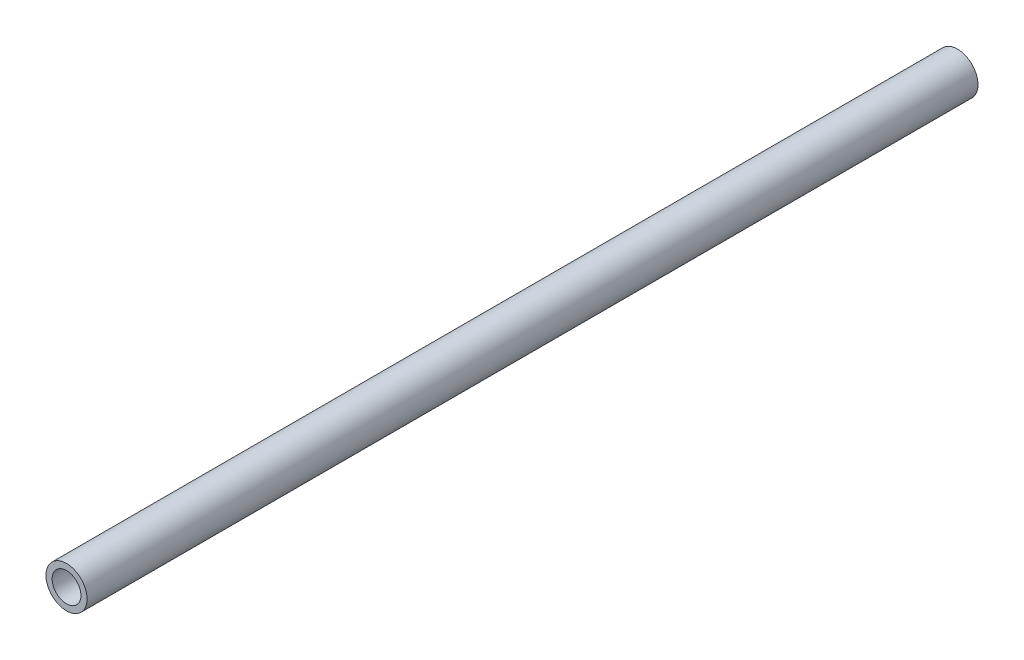
ISO-10303-21;
HEADER;
FILE_DESCRIPTION(('STEP AP214'),'2;1');
FILE_NAME('part.step','',(''),(''),'','','');
FILE_SCHEMA(('AUTOMOTIVE_DESIGN { 1 0 10303 214 1 1 1 1 }'));
ENDSEC;
DATA;
#1=APPLICATION_CONTEXT('core data for automotive mechanical design processes');
#2=APPLICATION_PROTOCOL_DEFINITION('international standard','automotive_design',2000,#1);
#3=PRODUCT_CONTEXT('',#1,'mechanical');
#4=PRODUCT('Part','Part','',(#3));
#5=PRODUCT_RELATED_PRODUCT_CATEGORY('part','',(#4));
#6=PRODUCT_DEFINITION_FORMATION('','',#4);
#7=PRODUCT_DEFINITION_CONTEXT('part definition',#1,'design');
#8=PRODUCT_DEFINITION('design','',#6,#7);
#9=PRODUCT_DEFINITION_SHAPE('','',#8);
#10=(LENGTH_UNIT() NAMED_UNIT(*) SI_UNIT(.MILLI.,.METRE.));
#11=(NAMED_UNIT(*) PLANE_ANGLE_UNIT() SI_UNIT($,.RADIAN.));
#12=(NAMED_UNIT(*) SI_UNIT($,.STERADIAN.) SOLID_ANGLE_UNIT());
#13=UNCERTAINTY_MEASURE_WITH_UNIT(LENGTH_MEASURE(1.E-05),#10,'distance_accuracy_value','');
#14=(GEOMETRIC_REPRESENTATION_CONTEXT(3) GLOBAL_UNCERTAINTY_ASSIGNED_CONTEXT((#13)) GLOBAL_UNIT_ASSIGNED_CONTEXT((#10,
#11,#12)) REPRESENTATION_CONTEXT('',''));
#15=CARTESIAN_POINT('',(0.,0.,0.));
#16=DIRECTION('',(0.,0.,1.));
#17=DIRECTION('',(1.,0.,0.));
#18=AXIS2_PLACEMENT_3D('',#15,#16,#17);
#19=CARTESIAN_POINT('',(0.,0.,145.));
#20=DIRECTION('',(0.,0.,1.));
#21=DIRECTION('',(1.,0.,0.));
#22=AXIS2_PLACEMENT_3D('',#19,#20,#21);
#23=PLANE('',#22);
#24=CARTESIAN_POINT('',(0.,0.,145.));
#25=DIRECTION('',(0.,0.,1.));
#26=DIRECTION('',(1.,0.,0.));
#27=AXIS2_PLACEMENT_3D('',#24,#25,#26);
#28=CIRCLE('',#27,3.345);
#29=CARTESIAN_POINT('',(3.345,0.,145.));
#30=VERTEX_POINT('',#29);
#31=EDGE_CURVE('E10',#30,#30,#28,.T.);
#32=ORIENTED_EDGE('',*,*,#31,.T.);
#33=EDGE_LOOP('',(#32));
#34=FACE_BOUND('',#33,.T.);
#35=CARTESIAN_POINT('',(0.,0.,145.));
#36=DIRECTION('',(0.,0.,1.));
#37=DIRECTION('',(1.,0.,0.));
#38=AXIS2_PLACEMENT_3D('',#35,#36,#37);
#39=CIRCLE('',#38,2.345);
#40=CARTESIAN_POINT('',(2.345,0.,145.));
#41=VERTEX_POINT('',#40);
#42=EDGE_CURVE('E45',#41,#41,#39,.T.);
#43=ORIENTED_EDGE('',*,*,#42,.F.);
#44=EDGE_LOOP('',(#43));
#45=FACE_BOUND('',#44,.T.);
#46=ADVANCED_FACE('F34',(#34,#45),#23,.T.);
#47=CARTESIAN_POINT('',(0.,0.,0.));
#48=DIRECTION('',(0.,0.,1.));
#49=DIRECTION('',(1.,0.,0.));
#50=AXIS2_PLACEMENT_3D('',#47,#48,#49);
#51=PLANE('',#50);
#52=CARTESIAN_POINT('',(0.,0.,0.));
#53=DIRECTION('',(0.,0.,1.));
#54=DIRECTION('',(1.,0.,0.));
#55=AXIS2_PLACEMENT_3D('',#52,#53,#54);
#56=CIRCLE('',#55,3.345);
#57=CARTESIAN_POINT('',(3.345,0.,0.));
#58=VERTEX_POINT('',#57);
#59=EDGE_CURVE('E38',#58,#58,#56,.T.);
#60=ORIENTED_EDGE('',*,*,#59,.F.);
#61=EDGE_LOOP('',(#60));
#62=FACE_BOUND('',#61,.T.);
#63=CARTESIAN_POINT('',(0.,0.,0.));
#64=DIRECTION('',(0.,0.,1.));
#65=DIRECTION('',(1.,0.,0.));
#66=AXIS2_PLACEMENT_3D('',#63,#64,#65);
#67=CIRCLE('',#66,2.345);
#68=CARTESIAN_POINT('',(2.345,0.,0.));
#69=VERTEX_POINT('',#68);
#70=EDGE_CURVE('E47',#69,#69,#67,.T.);
#71=ORIENTED_EDGE('',*,*,#70,.T.);
#72=EDGE_LOOP('',(#71));
#73=FACE_BOUND('',#72,.T.);
#74=ADVANCED_FACE('F57',(#62,#73),#51,.F.);
#75=CARTESIAN_POINT('',(0.,0.,145.));
#76=DIRECTION('',(0.,0.,-1.));
#77=DIRECTION('',(-1.,0.,0.));
#78=AXIS2_PLACEMENT_3D('',#75,#76,#77);
#79=CYLINDRICAL_SURFACE('',#78,3.345);
#80=ORIENTED_EDGE('',*,*,#31,.F.);
#81=EDGE_LOOP('',(#80));
#82=FACE_BOUND('',#81,.T.);
#83=ORIENTED_EDGE('',*,*,#59,.T.);
#84=EDGE_LOOP('',(#83));
#85=FACE_BOUND('',#84,.T.);
#86=ADVANCED_FACE('F36',(#82,#85),#79,.T.);
#87=CARTESIAN_POINT('',(0.,0.,145.));
#88=DIRECTION('',(0.,0.,-1.));
#89=DIRECTION('',(-1.,0.,0.));
#90=AXIS2_PLACEMENT_3D('',#87,#88,#89);
#91=CYLINDRICAL_SURFACE('',#90,2.345);
#92=ORIENTED_EDGE('',*,*,#42,.T.);
#93=EDGE_LOOP('',(#92));
#94=FACE_BOUND('',#93,.T.);
#95=ORIENTED_EDGE('',*,*,#70,.F.);
#96=EDGE_LOOP('',(#95));
#97=FACE_BOUND('',#96,.T.);
#98=ADVANCED_FACE('F53',(#94,#97),#91,.F.);
#99=CLOSED_SHELL('',(#46,#74,#86,#98));
#100=MANIFOLD_SOLID_BREP('B2',#99);
#101=ADVANCED_BREP_SHAPE_REPRESENTATION('',(#18,#100),#14);
#102=SHAPE_DEFINITION_REPRESENTATION(#9,#101);
ENDSEC;
END-ISO-10303-21;
